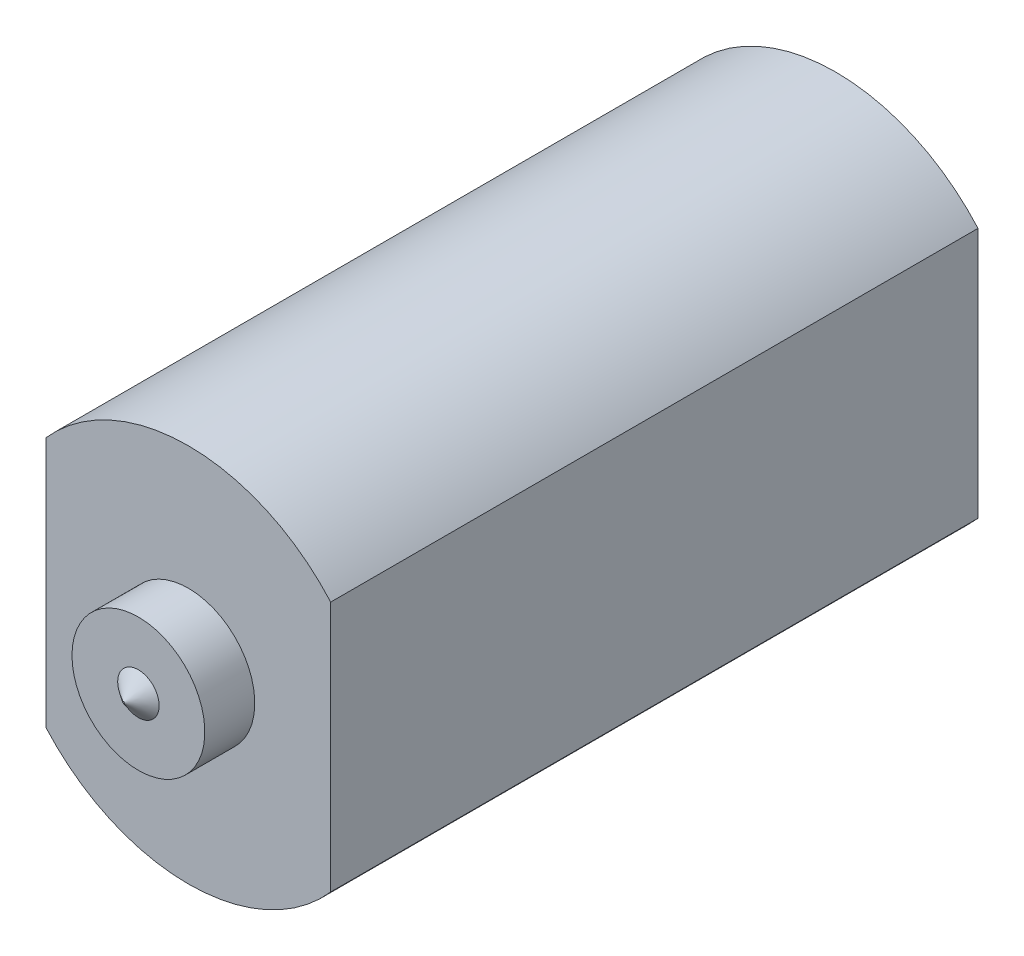
ISO-10303-21;
HEADER;
FILE_DESCRIPTION(('STEP AP214'),'2;1');
FILE_NAME('part.step','',(''),(''),'','','');
FILE_SCHEMA(('AUTOMOTIVE_DESIGN { 1 0 10303 214 1 1 1 1 }'));
ENDSEC;
DATA;
#1=APPLICATION_CONTEXT('core data for automotive mechanical design processes');
#2=APPLICATION_PROTOCOL_DEFINITION('international standard','automotive_design',2000,#1);
#3=PRODUCT_CONTEXT('',#1,'mechanical');
#4=PRODUCT('Part','Part','',(#3));
#5=PRODUCT_RELATED_PRODUCT_CATEGORY('part','',(#4));
#6=PRODUCT_DEFINITION_FORMATION('','',#4);
#7=PRODUCT_DEFINITION_CONTEXT('part definition',#1,'design');
#8=PRODUCT_DEFINITION('design','',#6,#7);
#9=PRODUCT_DEFINITION_SHAPE('','',#8);
#10=(LENGTH_UNIT() NAMED_UNIT(*) SI_UNIT(.MILLI.,.METRE.));
#11=(NAMED_UNIT(*) PLANE_ANGLE_UNIT() SI_UNIT($,.RADIAN.));
#12=(NAMED_UNIT(*) SI_UNIT($,.STERADIAN.) SOLID_ANGLE_UNIT());
#13=UNCERTAINTY_MEASURE_WITH_UNIT(LENGTH_MEASURE(1.E-05),#10,'distance_accuracy_value','');
#14=(GEOMETRIC_REPRESENTATION_CONTEXT(3) GLOBAL_UNCERTAINTY_ASSIGNED_CONTEXT((#13)) GLOBAL_UNIT_ASSIGNED_CONTEXT((#10,
#11,#12)) REPRESENTATION_CONTEXT('',''));
#15=CARTESIAN_POINT('',(0.,0.,0.));
#16=DIRECTION('',(0.,0.,1.));
#17=DIRECTION('',(1.,0.,0.));
#18=AXIS2_PLACEMENT_3D('',#15,#16,#17);
#19=CARTESIAN_POINT('',(0.,0.,6.604));
#20=DIRECTION('',(0.,0.,1.));
#21=DIRECTION('',(1.,0.,0.));
#22=AXIS2_PLACEMENT_3D('',#19,#20,#21);
#23=PLANE('',#22);
#24=CARTESIAN_POINT('',(0.,0.,6.60400000003847));
#25=DIRECTION('',(0.,0.,-1.));
#26=DIRECTION('',(-1.,0.,0.));
#27=AXIS2_PLACEMENT_3D('',#24,#25,#26);
#28=CIRCLE('',#27,0.0857836917589339);
#29=CARTESIAN_POINT('',(-0.0857836917589339,0.,6.60400000003847));
#30=VERTEX_POINT('',#29);
#31=EDGE_CURVE('E17',#30,#30,#28,.T.);
#32=ORIENTED_EDGE('',*,*,#31,.F.);
#33=EDGE_LOOP('',(#32));
#34=FACE_BOUND('',#33,.T.);
#35=ADVANCED_FACE('F14',(#34),#23,.T.);
#36=CARTESIAN_POINT('',(0.,0.,5.07999999990716));
#37=DIRECTION('',(0.,0.,-1.));
#38=DIRECTION('',(-1.,0.,0.));
#39=AXIS2_PLACEMENT_3D('',#36,#37,#38);
#40=CONICAL_SURFACE('',#39,2.10820000012291,0.925024503566552);
#41=CARTESIAN_POINT('',(0.,0.,5.07999999999283));
#42=DIRECTION('',(0.,0.,-1.));
#43=DIRECTION('',(-1.,0.,0.));
#44=AXIS2_PLACEMENT_3D('',#41,#42,#43);
#45=CIRCLE('',#44,2.10820000000922);
#46=CARTESIAN_POINT('',(-2.10820000000922,0.,5.07999999999283));
#47=VERTEX_POINT('',#46);
#48=EDGE_CURVE('E89',#47,#47,#45,.T.);
#49=ORIENTED_EDGE('',*,*,#48,.F.);
#50=EDGE_LOOP('',(#49));
#51=FACE_BOUND('',#50,.T.);
#52=ORIENTED_EDGE('',*,*,#31,.T.);
#53=EDGE_LOOP('',(#52));
#54=FACE_BOUND('',#53,.T.);
#55=ADVANCED_FACE('F96',(#51,#54),#40,.T.);
#56=CARTESIAN_POINT('',(0.,0.,5.08));
#57=DIRECTION('',(0.,0.,1.));
#58=DIRECTION('',(1.,0.,0.));
#59=AXIS2_PLACEMENT_3D('',#56,#57,#58);
#60=PLANE('',#59);
#61=ORIENTED_EDGE('',*,*,#48,.T.);
#62=EDGE_LOOP('',(#61));
#63=FACE_BOUND('',#62,.T.);
#64=CARTESIAN_POINT('',(0.,0.,5.08));
#65=DIRECTION('',(0.,0.,-1.));
#66=DIRECTION('',(-1.,0.,0.));
#67=AXIS2_PLACEMENT_3D('',#64,#65,#66);
#68=CIRCLE('',#67,6.7564);
#69=CARTESIAN_POINT('',(-6.7564,0.,5.08));
#70=VERTEX_POINT('',#69);
#71=EDGE_CURVE('E63',#70,#70,#68,.T.);
#72=ORIENTED_EDGE('',*,*,#71,.F.);
#73=EDGE_LOOP('',(#72));
#74=FACE_BOUND('',#73,.T.);
#75=ADVANCED_FACE('F105',(#63,#74),#60,.T.);
#76=CARTESIAN_POINT('',(0.,0.,5.08));
#77=DIRECTION('',(0.,0.,-1.));
#78=DIRECTION('',(-1.,0.,0.));
#79=AXIS2_PLACEMENT_3D('',#76,#77,#78);
#80=CYLINDRICAL_SURFACE('',#79,6.7564);
#81=CARTESIAN_POINT('',(0.,0.,0.));
#82=DIRECTION('',(0.,0.,-1.));
#83=DIRECTION('',(-1.,0.,0.));
#84=AXIS2_PLACEMENT_3D('',#81,#82,#83);
#85=CIRCLE('',#84,6.7564);
#86=CARTESIAN_POINT('',(-6.7564,0.,0.));
#87=VERTEX_POINT('',#86);
#88=EDGE_CURVE('E62',#87,#87,#85,.T.);
#89=ORIENTED_EDGE('',*,*,#88,.F.);
#90=EDGE_LOOP('',(#89));
#91=FACE_BOUND('',#90,.T.);
#92=ORIENTED_EDGE('',*,*,#71,.T.);
#93=EDGE_LOOP('',(#92));
#94=FACE_BOUND('',#93,.T.);
#95=ADVANCED_FACE('F130',(#91,#94),#80,.T.);
#96=CARTESIAN_POINT('',(0.,0.,-65.8368));
#97=DIRECTION('',(0.,0.,1.));
#98=DIRECTION('',(1.,0.,0.));
#99=AXIS2_PLACEMENT_3D('',#96,#97,#98);
#100=CYLINDRICAL_SURFACE('',#99,19.304);
#101=CARTESIAN_POINT('',(0.,0.,-65.8368));
#102=DIRECTION('',(0.,0.,1.));
#103=DIRECTION('',(1.,0.,0.));
#104=AXIS2_PLACEMENT_3D('',#101,#102,#103);
#105=CIRCLE('',#104,19.304);
#106=CARTESIAN_POINT('',(14.478,12.7683958271977,-65.8368));
#107=VERTEX_POINT('',#106);
#108=CARTESIAN_POINT('',(-14.478,12.7683958271977,-65.8368));
#109=VERTEX_POINT('',#108);
#110=EDGE_CURVE('E81',#107,#109,#105,.T.);
#111=ORIENTED_EDGE('',*,*,#110,.T.);
#112=DIRECTION('',(0.,0.,1.));
#113=VECTOR('',#112,1.);
#114=CARTESIAN_POINT('',(-14.478,12.7683958271977,-65.8368));
#115=LINE('',#114,#113);
#116=CARTESIAN_POINT('',(-14.478,12.7683958271977,0.));
#117=VERTEX_POINT('',#116);
#118=EDGE_CURVE('E59',#117,#109,#115,.F.);
#119=ORIENTED_EDGE('',*,*,#118,.F.);
#120=CARTESIAN_POINT('',(0.,0.,0.));
#121=DIRECTION('',(0.,0.,1.));
#122=DIRECTION('',(1.,0.,0.));
#123=AXIS2_PLACEMENT_3D('',#120,#121,#122);
#124=CIRCLE('',#123,19.304);
#125=CARTESIAN_POINT('',(14.478,12.7683958271977,0.));
#126=VERTEX_POINT('',#125);
#127=EDGE_CURVE('E53',#126,#117,#124,.T.);
#128=ORIENTED_EDGE('',*,*,#127,.F.);
#129=DIRECTION('',(0.,0.,-1.));
#130=VECTOR('',#129,1.);
#131=CARTESIAN_POINT('',(14.478,12.7683958271977,-65.8368));
#132=LINE('',#131,#130);
#133=EDGE_CURVE('E57',#107,#126,#132,.F.);
#134=ORIENTED_EDGE('',*,*,#133,.F.);
#135=EDGE_LOOP('',(#111,#119,#128,#134));
#136=FACE_BOUND('',#135,.T.);
#137=ADVANCED_FACE('F55',(#136),#100,.T.);
#138=CARTESIAN_POINT('',(0.,-42.6102213562373,0.));
#139=DIRECTION('',(0.,0.,1.));
#140=DIRECTION('',(1.,0.,0.));
#141=AXIS2_PLACEMENT_3D('',#138,#139,#140);
#142=PLANE('',#141);
#143=ORIENTED_EDGE('',*,*,#88,.T.);
#144=EDGE_LOOP('',(#143));
#145=FACE_BOUND('',#144,.T.);
#146=DIRECTION('',(0.,1.,0.));
#147=VECTOR('',#146,1.);
#148=CARTESIAN_POINT('',(-14.478,-42.6102213562373,0.));
#149=LINE('',#148,#147);
#150=CARTESIAN_POINT('',(-14.478,-12.7683958271977,0.));
#151=VERTEX_POINT('',#150);
#152=EDGE_CURVE('E82',#151,#117,#149,.T.);
#153=ORIENTED_EDGE('',*,*,#152,.F.);
#154=CARTESIAN_POINT('',(0.,0.,0.));
#155=DIRECTION('',(0.,0.,1.));
#156=DIRECTION('',(1.,0.,0.));
#157=AXIS2_PLACEMENT_3D('',#154,#155,#156);
#158=CIRCLE('',#157,19.304);
#159=CARTESIAN_POINT('',(14.478,-12.7683958271977,0.));
#160=VERTEX_POINT('',#159);
#161=EDGE_CURVE('E69',#160,#151,#158,.F.);
#162=ORIENTED_EDGE('',*,*,#161,.F.);
#163=DIRECTION('',(0.,1.,0.));
#164=VECTOR('',#163,1.);
#165=CARTESIAN_POINT('',(14.478,-42.6102213562373,0.));
#166=LINE('',#165,#164);
#167=EDGE_CURVE('E66',#126,#160,#166,.F.);
#168=ORIENTED_EDGE('',*,*,#167,.F.);
#169=ORIENTED_EDGE('',*,*,#127,.T.);
#170=EDGE_LOOP('',(#153,#162,#168,#169));
#171=FACE_BOUND('',#170,.T.);
#172=ADVANCED_FACE('F67',(#145,#171),#142,.T.);
#173=CARTESIAN_POINT('',(-14.478,-42.6102213562373,-65.8368));
#174=DIRECTION('',(-1.,0.,0.));
#175=DIRECTION('',(0.,0.,1.));
#176=AXIS2_PLACEMENT_3D('',#173,#174,#175);
#177=PLANE('',#176);
#178=DIRECTION('',(0.,1.,0.));
#179=VECTOR('',#178,1.);
#180=CARTESIAN_POINT('',(-14.478,-42.6102213562373,-65.8368));
#181=LINE('',#180,#179);
#182=CARTESIAN_POINT('',(-14.478,-12.7683958271977,-65.8368));
#183=VERTEX_POINT('',#182);
#184=EDGE_CURVE('E71',#109,#183,#181,.F.);
#185=ORIENTED_EDGE('',*,*,#184,.T.);
#186=DIRECTION('',(0.,0.,1.));
#187=VECTOR('',#186,1.);
#188=CARTESIAN_POINT('',(-14.478,-12.7683958271977,-65.8368));
#189=LINE('',#188,#187);
#190=EDGE_CURVE('E75',#151,#183,#189,.F.);
#191=ORIENTED_EDGE('',*,*,#190,.F.);
#192=ORIENTED_EDGE('',*,*,#152,.T.);
#193=ORIENTED_EDGE('',*,*,#118,.T.);
#194=EDGE_LOOP('',(#185,#191,#192,#193));
#195=FACE_BOUND('',#194,.T.);
#196=ADVANCED_FACE('F121',(#195),#177,.T.);
#197=CARTESIAN_POINT('',(0.,-42.6102213562373,-65.8368));
#198=DIRECTION('',(0.,0.,1.));
#199=DIRECTION('',(1.,0.,0.));
#200=AXIS2_PLACEMENT_3D('',#197,#198,#199);
#201=PLANE('',#200);
#202=CARTESIAN_POINT('',(0.,0.,-65.8368));
#203=DIRECTION('',(0.,0.,1.));
#204=DIRECTION('',(1.,0.,0.));
#205=AXIS2_PLACEMENT_3D('',#202,#203,#204);
#206=CIRCLE('',#205,19.304);
#207=CARTESIAN_POINT('',(14.478,-12.7683958271977,-65.8368));
#208=VERTEX_POINT('',#207);
#209=EDGE_CURVE('E23',#183,#208,#206,.T.);
#210=ORIENTED_EDGE('',*,*,#209,.F.);
#211=ORIENTED_EDGE('',*,*,#184,.F.);
#212=ORIENTED_EDGE('',*,*,#110,.F.);
#213=DIRECTION('',(0.,1.,0.));
#214=VECTOR('',#213,1.);
#215=CARTESIAN_POINT('',(14.478,-42.6102213562373,-65.8368));
#216=LINE('',#215,#214);
#217=EDGE_CURVE('E32',#208,#107,#216,.T.);
#218=ORIENTED_EDGE('',*,*,#217,.F.);
#219=EDGE_LOOP('',(#210,#211,#212,#218));
#220=FACE_BOUND('',#219,.T.);
#221=ADVANCED_FACE('F116',(#220),#201,.F.);
#222=CARTESIAN_POINT('',(14.478,-42.6102213562373,-65.8368));
#223=DIRECTION('',(1.,0.,0.));
#224=DIRECTION('',(0.,0.,-1.));
#225=AXIS2_PLACEMENT_3D('',#222,#223,#224);
#226=PLANE('',#225);
#227=ORIENTED_EDGE('',*,*,#217,.T.);
#228=ORIENTED_EDGE('',*,*,#133,.T.);
#229=ORIENTED_EDGE('',*,*,#167,.T.);
#230=DIRECTION('',(0.,0.,1.));
#231=VECTOR('',#230,1.);
#232=CARTESIAN_POINT('',(14.478,-12.7683958271977,-65.8368));
#233=LINE('',#232,#231);
#234=EDGE_CURVE('E9',#208,#160,#233,.T.);
#235=ORIENTED_EDGE('',*,*,#234,.F.);
#236=EDGE_LOOP('',(#227,#228,#229,#235));
#237=FACE_BOUND('',#236,.T.);
#238=ADVANCED_FACE('F73',(#237),#226,.T.);
#239=CARTESIAN_POINT('',(0.,0.,-65.8368));
#240=DIRECTION('',(0.,0.,1.));
#241=DIRECTION('',(1.,0.,0.));
#242=AXIS2_PLACEMENT_3D('',#239,#240,#241);
#243=CYLINDRICAL_SURFACE('',#242,19.304);
#244=ORIENTED_EDGE('',*,*,#209,.T.);
#245=ORIENTED_EDGE('',*,*,#234,.T.);
#246=ORIENTED_EDGE('',*,*,#161,.T.);
#247=ORIENTED_EDGE('',*,*,#190,.T.);
#248=EDGE_LOOP('',(#244,#245,#246,#247));
#249=FACE_BOUND('',#248,.T.);
#250=ADVANCED_FACE('F107',(#249),#243,.T.);
#251=CLOSED_SHELL('',(#35,#55,#75,#95,#137,#172,#196,#221,#238,#250));
#252=MANIFOLD_SOLID_BREP('B1',#251);
#253=ADVANCED_BREP_SHAPE_REPRESENTATION('',(#18,#252),#14);
#254=SHAPE_DEFINITION_REPRESENTATION(#9,#253);
ENDSEC;
END-ISO-10303-21;
